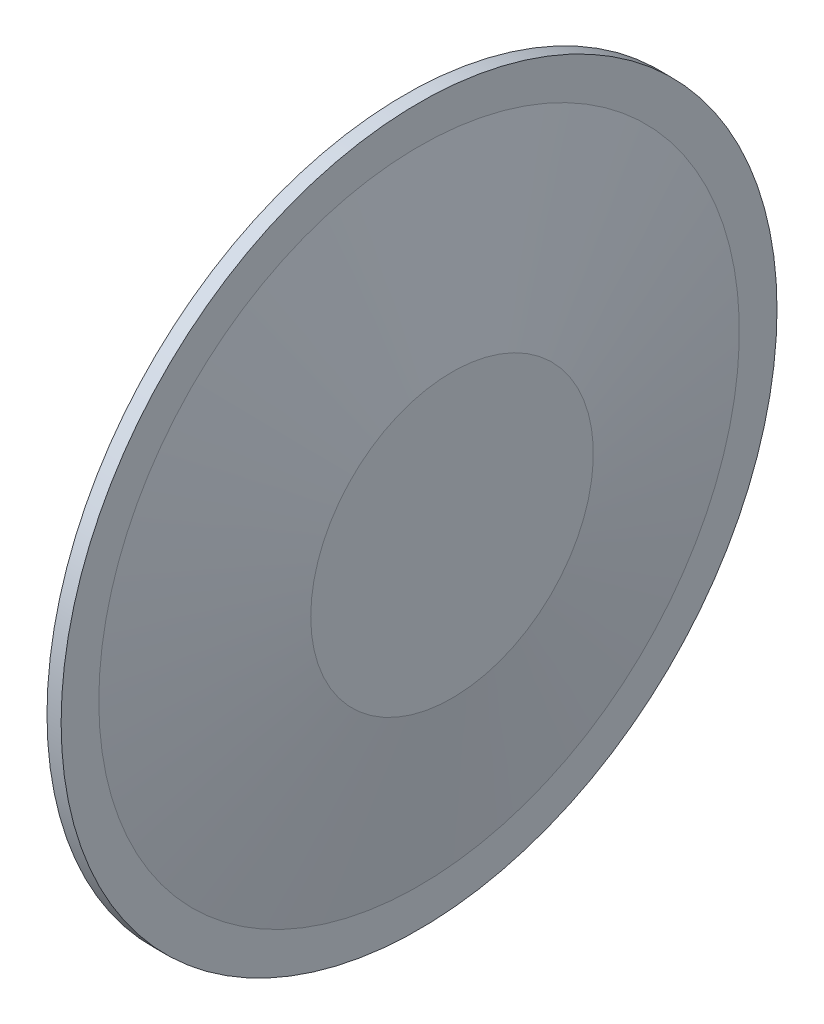
ISO-10303-21;
HEADER;
FILE_DESCRIPTION(('STEP AP214'),'2;1');
FILE_NAME('part.step','',(''),(''),'','','');
FILE_SCHEMA(('AUTOMOTIVE_DESIGN { 1 0 10303 214 1 1 1 1 }'));
ENDSEC;
DATA;
#1=APPLICATION_CONTEXT('core data for automotive mechanical design processes');
#2=APPLICATION_PROTOCOL_DEFINITION('international standard','automotive_design',2000,#1);
#3=PRODUCT_CONTEXT('',#1,'mechanical');
#4=PRODUCT('Part','Part','',(#3));
#5=PRODUCT_RELATED_PRODUCT_CATEGORY('part','',(#4));
#6=PRODUCT_DEFINITION_FORMATION('','',#4);
#7=PRODUCT_DEFINITION_CONTEXT('part definition',#1,'design');
#8=PRODUCT_DEFINITION('design','',#6,#7);
#9=PRODUCT_DEFINITION_SHAPE('','',#8);
#10=(LENGTH_UNIT() NAMED_UNIT(*) SI_UNIT(.MILLI.,.METRE.));
#11=(NAMED_UNIT(*) PLANE_ANGLE_UNIT() SI_UNIT($,.RADIAN.));
#12=(NAMED_UNIT(*) SI_UNIT($,.STERADIAN.) SOLID_ANGLE_UNIT());
#13=UNCERTAINTY_MEASURE_WITH_UNIT(LENGTH_MEASURE(1.E-05),#10,'distance_accuracy_value','');
#14=(GEOMETRIC_REPRESENTATION_CONTEXT(3) GLOBAL_UNCERTAINTY_ASSIGNED_CONTEXT((#13)) GLOBAL_UNIT_ASSIGNED_CONTEXT((#10,
#11,#12)) REPRESENTATION_CONTEXT('',''));
#15=CARTESIAN_POINT('',(0.,0.,0.));
#16=DIRECTION('',(0.,0.,1.));
#17=DIRECTION('',(1.,0.,0.));
#18=AXIS2_PLACEMENT_3D('',#15,#16,#17);
#19=CARTESIAN_POINT('',(0.,0.,0.));
#20=DIRECTION('',(-1.,0.,0.));
#21=DIRECTION('',(0.,0.,1.));
#22=AXIS2_PLACEMENT_3D('',#19,#20,#21);
#23=CONICAL_SURFACE('',#22,33.8629946772736,1.38862801632213);
#24=CARTESIAN_POINT('',(3.5,0.,0.));
#25=DIRECTION('',(-1.,0.,0.));
#26=DIRECTION('',(0.,0.,1.));
#27=AXIS2_PLACEMENT_3D('',#24,#25,#26);
#28=CIRCLE('',#27,14.8629946772736);
#29=CARTESIAN_POINT('',(3.5,0.,14.8629946772736));
#30=VERTEX_POINT('',#29);
#31=EDGE_CURVE('E94',#30,#30,#28,.T.);
#32=ORIENTED_EDGE('',*,*,#31,.F.);
#33=EDGE_LOOP('',(#32));
#34=FACE_BOUND('',#33,.T.);
#35=CARTESIAN_POINT('',(0.,0.,0.));
#36=DIRECTION('',(-1.,0.,0.));
#37=DIRECTION('',(0.,0.,1.));
#38=AXIS2_PLACEMENT_3D('',#35,#36,#37);
#39=CIRCLE('',#38,33.8629946772736);
#40=CARTESIAN_POINT('',(0.,0.,33.8629946772736));
#41=VERTEX_POINT('',#40);
#42=EDGE_CURVE('E74',#41,#41,#39,.T.);
#43=ORIENTED_EDGE('',*,*,#42,.T.);
#44=EDGE_LOOP('',(#43));
#45=FACE_BOUND('',#44,.T.);
#46=ADVANCED_FACE('F38',(#34,#45),#23,.F.);
#47=CARTESIAN_POINT('',(0.,33.8629946772736,0.));
#48=DIRECTION('',(1.,0.,0.));
#49=DIRECTION('',(0.,0.,-1.));
#50=AXIS2_PLACEMENT_3D('',#47,#48,#49);
#51=PLANE('',#50);
#52=ORIENTED_EDGE('',*,*,#42,.F.);
#53=EDGE_LOOP('',(#52));
#54=FACE_BOUND('',#53,.T.);
#55=CARTESIAN_POINT('',(0.,0.,0.));
#56=DIRECTION('',(-1.,0.,0.));
#57=DIRECTION('',(0.,0.,1.));
#58=AXIS2_PLACEMENT_3D('',#55,#56,#57);
#59=CIRCLE('',#58,38.);
#60=CARTESIAN_POINT('',(0.,0.,38.));
#61=VERTEX_POINT('',#60);
#62=EDGE_CURVE('E78',#61,#61,#59,.T.);
#63=ORIENTED_EDGE('',*,*,#62,.T.);
#64=EDGE_LOOP('',(#63));
#65=FACE_BOUND('',#64,.T.);
#66=ADVANCED_FACE('F103',(#54,#65),#51,.F.);
#67=CARTESIAN_POINT('',(0.,0.,0.));
#68=DIRECTION('',(-1.,0.,0.));
#69=DIRECTION('',(0.,0.,1.));
#70=AXIS2_PLACEMENT_3D('',#67,#68,#69);
#71=CYLINDRICAL_SURFACE('',#70,38.);
#72=ORIENTED_EDGE('',*,*,#62,.F.);
#73=EDGE_LOOP('',(#72));
#74=FACE_BOUND('',#73,.T.);
#75=CARTESIAN_POINT('',(1.5,0.,0.));
#76=DIRECTION('',(-1.,0.,0.));
#77=DIRECTION('',(0.,0.,1.));
#78=AXIS2_PLACEMENT_3D('',#75,#76,#77);
#79=CIRCLE('',#78,38.);
#80=CARTESIAN_POINT('',(1.5,0.,38.));
#81=VERTEX_POINT('',#80);
#82=EDGE_CURVE('E82',#81,#81,#79,.T.);
#83=ORIENTED_EDGE('',*,*,#82,.T.);
#84=EDGE_LOOP('',(#83));
#85=FACE_BOUND('',#84,.T.);
#86=ADVANCED_FACE('F109',(#74,#85),#71,.T.);
#87=CARTESIAN_POINT('',(1.5,38.,0.));
#88=DIRECTION('',(-1.,0.,0.));
#89=DIRECTION('',(0.,0.,1.));
#90=AXIS2_PLACEMENT_3D('',#87,#88,#89);
#91=PLANE('',#90);
#92=ORIENTED_EDGE('',*,*,#82,.F.);
#93=EDGE_LOOP('',(#92));
#94=FACE_BOUND('',#93,.T.);
#95=CARTESIAN_POINT('',(1.5,0.,0.));
#96=DIRECTION('',(-1.,0.,0.));
#97=DIRECTION('',(0.,0.,1.));
#98=AXIS2_PLACEMENT_3D('',#95,#96,#97);
#99=CIRCLE('',#98,34.);
#100=CARTESIAN_POINT('',(1.5,0.,34.));
#101=VERTEX_POINT('',#100);
#102=EDGE_CURVE('E86',#101,#101,#99,.T.);
#103=ORIENTED_EDGE('',*,*,#102,.T.);
#104=EDGE_LOOP('',(#103));
#105=FACE_BOUND('',#104,.T.);
#106=ADVANCED_FACE('F115',(#94,#105),#91,.F.);
#107=CARTESIAN_POINT('',(5.,0.,0.));
#108=DIRECTION('',(-1.,0.,0.));
#109=DIRECTION('',(0.,0.,1.));
#110=AXIS2_PLACEMENT_3D('',#107,#108,#109);
#111=CONICAL_SURFACE('',#110,15.,1.38862801632213);
#112=ORIENTED_EDGE('',*,*,#102,.F.);
#113=EDGE_LOOP('',(#112));
#114=FACE_BOUND('',#113,.T.);
#115=CARTESIAN_POINT('',(5.,0.,0.));
#116=DIRECTION('',(-1.,0.,0.));
#117=DIRECTION('',(0.,0.,1.));
#118=AXIS2_PLACEMENT_3D('',#115,#116,#117);
#119=CIRCLE('',#118,15.);
#120=CARTESIAN_POINT('',(5.,0.,15.));
#121=VERTEX_POINT('',#120);
#122=EDGE_CURVE('E90',#121,#121,#119,.T.);
#123=ORIENTED_EDGE('',*,*,#122,.T.);
#124=EDGE_LOOP('',(#123));
#125=FACE_BOUND('',#124,.T.);
#126=ADVANCED_FACE('F121',(#114,#125),#111,.T.);
#127=CARTESIAN_POINT('',(5.,15.,0.));
#128=DIRECTION('',(-1.,0.,0.));
#129=DIRECTION('',(0.,0.,1.));
#130=AXIS2_PLACEMENT_3D('',#127,#128,#129);
#131=PLANE('',#130);
#132=ORIENTED_EDGE('',*,*,#122,.F.);
#133=EDGE_LOOP('',(#132));
#134=FACE_BOUND('',#133,.T.);
#135=ADVANCED_FACE('F127',(#134),#131,.F.);
#136=CARTESIAN_POINT('',(3.5,0.,0.));
#137=DIRECTION('',(1.,0.,0.));
#138=DIRECTION('',(0.,0.,-1.));
#139=AXIS2_PLACEMENT_3D('',#136,#137,#138);
#140=PLANE('',#139);
#141=CARTESIAN_POINT('',(3.5,0.,-9.525));
#142=DIRECTION('',(1.,0.,0.));
#143=DIRECTION('',(0.,0.,-1.));
#144=AXIS2_PLACEMENT_3D('',#141,#142,#143);
#145=CIRCLE('',#144,4.075);
#146=CARTESIAN_POINT('',(3.5,0.,-13.6));
#147=VERTEX_POINT('',#146);
#148=EDGE_CURVE('E52',#147,#147,#145,.T.);
#149=ORIENTED_EDGE('',*,*,#148,.T.);
#150=EDGE_LOOP('',(#149));
#151=FACE_BOUND('',#150,.T.);
#152=CARTESIAN_POINT('',(3.5,0.,9.525));
#153=DIRECTION('',(1.,0.,0.));
#154=DIRECTION('',(0.,0.,-1.));
#155=AXIS2_PLACEMENT_3D('',#152,#153,#154);
#156=CIRCLE('',#155,4.075);
#157=CARTESIAN_POINT('',(3.5,0.,5.45));
#158=VERTEX_POINT('',#157);
#159=EDGE_CURVE('E56',#158,#158,#156,.T.);
#160=ORIENTED_EDGE('',*,*,#159,.T.);
#161=EDGE_LOOP('',(#160));
#162=FACE_BOUND('',#161,.T.);
#163=ORIENTED_EDGE('',*,*,#31,.T.);
#164=EDGE_LOOP('',(#163));
#165=FACE_BOUND('',#164,.T.);
#166=ADVANCED_FACE('F99',(#151,#162,#165),#140,.F.);
#167=CARTESIAN_POINT('',(-5.5,0.,-9.525));
#168=DIRECTION('',(1.,0.,0.));
#169=DIRECTION('',(0.,0.,-1.));
#170=AXIS2_PLACEMENT_3D('',#167,#168,#169);
#171=CYLINDRICAL_SURFACE('',#170,1.575);
#172=CARTESIAN_POINT('',(1.,0.,-9.525));
#173=DIRECTION('',(1.,0.,0.));
#174=DIRECTION('',(0.,0.,-1.));
#175=AXIS2_PLACEMENT_3D('',#172,#173,#174);
#176=CIRCLE('',#175,1.575);
#177=CARTESIAN_POINT('',(1.,0.,-11.1));
#178=VERTEX_POINT('',#177);
#179=EDGE_CURVE('E46',#178,#178,#176,.F.);
#180=ORIENTED_EDGE('',*,*,#179,.T.);
#181=EDGE_LOOP('',(#180));
#182=FACE_BOUND('',#181,.T.);
#183=CARTESIAN_POINT('',(-4.5,0.,-9.525));
#184=DIRECTION('',(1.,0.,0.));
#185=DIRECTION('',(0.,0.,-1.));
#186=AXIS2_PLACEMENT_3D('',#183,#184,#185);
#187=CIRCLE('',#186,1.575);
#188=CARTESIAN_POINT('',(-4.5,0.,-11.1));
#189=VERTEX_POINT('',#188);
#190=EDGE_CURVE('E64',#189,#189,#187,.T.);
#191=ORIENTED_EDGE('',*,*,#190,.T.);
#192=EDGE_LOOP('',(#191));
#193=FACE_BOUND('',#192,.T.);
#194=ADVANCED_FACE('F136',(#182,#193),#171,.T.);
#195=CARTESIAN_POINT('',(-5.5,0.,-9.525));
#196=DIRECTION('',(1.,0.,0.));
#197=DIRECTION('',(0.,0.,-1.));
#198=AXIS2_PLACEMENT_3D('',#195,#196,#197);
#199=PLANE('',#198);
#200=CARTESIAN_POINT('',(-5.5,0.,-9.525));
#201=DIRECTION('',(1.,0.,0.));
#202=DIRECTION('',(0.,0.,-1.));
#203=AXIS2_PLACEMENT_3D('',#200,#201,#202);
#204=CIRCLE('',#203,0.575);
#205=CARTESIAN_POINT('',(-5.5,0.,-10.1));
#206=VERTEX_POINT('',#205);
#207=EDGE_CURVE('E61',#206,#206,#204,.F.);
#208=ORIENTED_EDGE('',*,*,#207,.T.);
#209=EDGE_LOOP('',(#208));
#210=FACE_BOUND('',#209,.T.);
#211=ADVANCED_FACE('F178',(#210),#199,.F.);
#212=CARTESIAN_POINT('',(-5.5,0.,9.525));
#213=DIRECTION('',(1.,0.,0.));
#214=DIRECTION('',(0.,0.,-1.));
#215=AXIS2_PLACEMENT_3D('',#212,#213,#214);
#216=CYLINDRICAL_SURFACE('',#215,1.575);
#217=CARTESIAN_POINT('',(1.,0.,9.525));
#218=DIRECTION('',(1.,0.,0.));
#219=DIRECTION('',(0.,0.,-1.));
#220=AXIS2_PLACEMENT_3D('',#217,#218,#219);
#221=CIRCLE('',#220,1.575);
#222=CARTESIAN_POINT('',(1.,0.,7.95));
#223=VERTEX_POINT('',#222);
#224=EDGE_CURVE('E10',#223,#223,#221,.F.);
#225=ORIENTED_EDGE('',*,*,#224,.T.);
#226=EDGE_LOOP('',(#225));
#227=FACE_BOUND('',#226,.T.);
#228=CARTESIAN_POINT('',(-4.5,0.,9.525));
#229=DIRECTION('',(1.,0.,0.));
#230=DIRECTION('',(0.,0.,-1.));
#231=AXIS2_PLACEMENT_3D('',#228,#229,#230);
#232=CIRCLE('',#231,1.575);
#233=CARTESIAN_POINT('',(-4.5,0.,7.95));
#234=VERTEX_POINT('',#233);
#235=EDGE_CURVE('E70',#234,#234,#232,.T.);
#236=ORIENTED_EDGE('',*,*,#235,.T.);
#237=EDGE_LOOP('',(#236));
#238=FACE_BOUND('',#237,.T.);
#239=ADVANCED_FACE('F173',(#227,#238),#216,.T.);
#240=CARTESIAN_POINT('',(-5.5,0.,9.525));
#241=DIRECTION('',(1.,0.,0.));
#242=DIRECTION('',(0.,0.,-1.));
#243=AXIS2_PLACEMENT_3D('',#240,#241,#242);
#244=PLANE('',#243);
#245=CARTESIAN_POINT('',(-5.5,0.,9.525));
#246=DIRECTION('',(1.,0.,0.));
#247=DIRECTION('',(0.,0.,-1.));
#248=AXIS2_PLACEMENT_3D('',#245,#246,#247);
#249=CIRCLE('',#248,0.575);
#250=CARTESIAN_POINT('',(-5.5,0.,8.95));
#251=VERTEX_POINT('',#250);
#252=EDGE_CURVE('E67',#251,#251,#249,.F.);
#253=ORIENTED_EDGE('',*,*,#252,.T.);
#254=EDGE_LOOP('',(#253));
#255=FACE_BOUND('',#254,.T.);
#256=ADVANCED_FACE('F145',(#255),#244,.F.);
#257=CARTESIAN_POINT('',(-4.5,0.,9.525));
#258=DIRECTION('',(1.,0.,0.));
#259=DIRECTION('',(0.,0.,-1.));
#260=AXIS2_PLACEMENT_3D('',#257,#258,#259);
#261=DEGENERATE_TOROIDAL_SURFACE('',#260,0.575,1.,.T.);
#262=ORIENTED_EDGE('',*,*,#252,.F.);
#263=EDGE_LOOP('',(#262));
#264=FACE_BOUND('',#263,.T.);
#265=ORIENTED_EDGE('',*,*,#235,.F.);
#266=EDGE_LOOP('',(#265));
#267=FACE_BOUND('',#266,.T.);
#268=ADVANCED_FACE('F141',(#264,#267),#261,.T.);
#269=CARTESIAN_POINT('',(-4.5,0.,-9.525));
#270=DIRECTION('',(1.,0.,0.));
#271=DIRECTION('',(0.,0.,-1.));
#272=AXIS2_PLACEMENT_3D('',#269,#270,#271);
#273=DEGENERATE_TOROIDAL_SURFACE('',#272,0.575,1.,.T.);
#274=ORIENTED_EDGE('',*,*,#207,.F.);
#275=EDGE_LOOP('',(#274));
#276=FACE_BOUND('',#275,.T.);
#277=ORIENTED_EDGE('',*,*,#190,.F.);
#278=EDGE_LOOP('',(#277));
#279=FACE_BOUND('',#278,.T.);
#280=ADVANCED_FACE('F144',(#276,#279),#273,.T.);
#281=CARTESIAN_POINT('',(1.,0.,-9.525));
#282=DIRECTION('',(1.,0.,0.));
#283=DIRECTION('',(0.,0.,-1.));
#284=AXIS2_PLACEMENT_3D('',#281,#282,#283);
#285=TOROIDAL_SURFACE('',#284,4.075,2.5);
#286=ORIENTED_EDGE('',*,*,#179,.F.);
#287=EDGE_LOOP('',(#286));
#288=FACE_BOUND('',#287,.T.);
#289=ORIENTED_EDGE('',*,*,#148,.F.);
#290=EDGE_LOOP('',(#289));
#291=FACE_BOUND('',#290,.T.);
#292=ADVANCED_FACE('F148',(#288,#291),#285,.F.);
#293=CARTESIAN_POINT('',(1.,0.,9.525));
#294=DIRECTION('',(1.,0.,0.));
#295=DIRECTION('',(0.,0.,-1.));
#296=AXIS2_PLACEMENT_3D('',#293,#294,#295);
#297=TOROIDAL_SURFACE('',#296,4.075,2.5);
#298=ORIENTED_EDGE('',*,*,#224,.F.);
#299=EDGE_LOOP('',(#298));
#300=FACE_BOUND('',#299,.T.);
#301=ORIENTED_EDGE('',*,*,#159,.F.);
#302=EDGE_LOOP('',(#301));
#303=FACE_BOUND('',#302,.T.);
#304=ADVANCED_FACE('F40',(#300,#303),#297,.F.);
#305=CLOSED_SHELL('',(#46,#66,#86,#106,#126,#135,#166,#194,#211,#239,#256,#268,#280,#292,#304));
#306=MANIFOLD_SOLID_BREP('B2',#305);
#307=ADVANCED_BREP_SHAPE_REPRESENTATION('',(#18,#306),#14);
#308=SHAPE_DEFINITION_REPRESENTATION(#9,#307);
ENDSEC;
END-ISO-10303-21;
